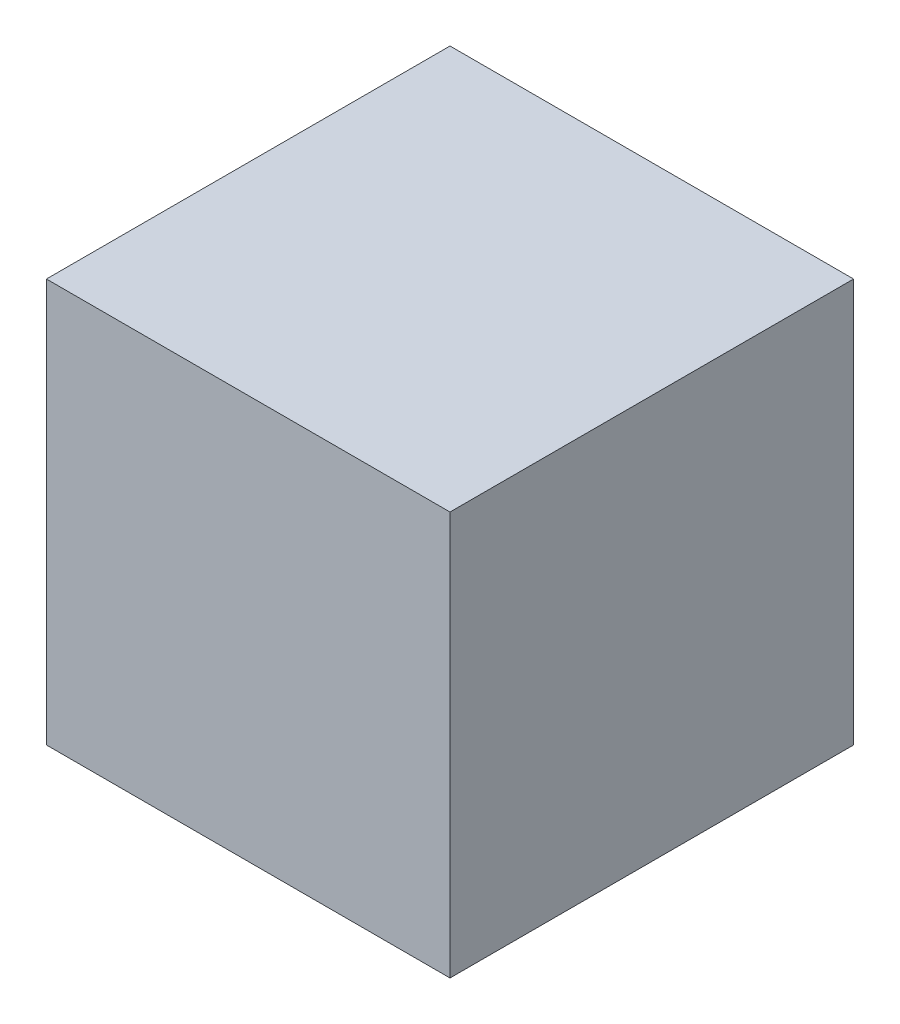
ISO-10303-21;
HEADER;
FILE_DESCRIPTION(('STEP AP214'),'2;1');
FILE_NAME('part.step','',(''),(''),'','','');
FILE_SCHEMA(('AUTOMOTIVE_DESIGN { 1 0 10303 214 1 1 1 1 }'));
ENDSEC;
DATA;
#1=APPLICATION_CONTEXT('core data for automotive mechanical design processes');
#2=APPLICATION_PROTOCOL_DEFINITION('international standard','automotive_design',2000,#1);
#3=PRODUCT_CONTEXT('',#1,'mechanical');
#4=PRODUCT('Part','Part','',(#3));
#5=PRODUCT_RELATED_PRODUCT_CATEGORY('part','',(#4));
#6=PRODUCT_DEFINITION_FORMATION('','',#4);
#7=PRODUCT_DEFINITION_CONTEXT('part definition',#1,'design');
#8=PRODUCT_DEFINITION('design','',#6,#7);
#9=PRODUCT_DEFINITION_SHAPE('','',#8);
#10=(LENGTH_UNIT() NAMED_UNIT(*) SI_UNIT(.MILLI.,.METRE.));
#11=(NAMED_UNIT(*) PLANE_ANGLE_UNIT() SI_UNIT($,.RADIAN.));
#12=(NAMED_UNIT(*) SI_UNIT($,.STERADIAN.) SOLID_ANGLE_UNIT());
#13=UNCERTAINTY_MEASURE_WITH_UNIT(LENGTH_MEASURE(1.E-05),#10,'distance_accuracy_value','');
#14=(GEOMETRIC_REPRESENTATION_CONTEXT(3) GLOBAL_UNCERTAINTY_ASSIGNED_CONTEXT((#13)) GLOBAL_UNIT_ASSIGNED_CONTEXT((#10,
#11,#12)) REPRESENTATION_CONTEXT('',''));
#15=CARTESIAN_POINT('',(0.,0.,0.));
#16=DIRECTION('',(0.,0.,1.));
#17=DIRECTION('',(1.,0.,0.));
#18=AXIS2_PLACEMENT_3D('',#15,#16,#17);
#19=CARTESIAN_POINT('',(50.,-50.,100.));
#20=DIRECTION('',(-1.,0.,0.));
#21=DIRECTION('',(0.,0.,1.));
#22=AXIS2_PLACEMENT_3D('',#19,#20,#21);
#23=PLANE('',#22);
#24=DIRECTION('',(0.,1.,0.));
#25=VECTOR('',#24,1.);
#26=CARTESIAN_POINT('',(50.,-50.,0.));
#27=LINE('',#26,#25);
#28=CARTESIAN_POINT('',(50.,-50.,0.));
#29=VERTEX_POINT('',#28);
#30=CARTESIAN_POINT('',(50.,50.,0.));
#31=VERTEX_POINT('',#30);
#32=EDGE_CURVE('E107',#29,#31,#27,.T.);
#33=ORIENTED_EDGE('',*,*,#32,.T.);
#34=DIRECTION('',(0.,0.,-1.));
#35=VECTOR('',#34,1.);
#36=CARTESIAN_POINT('',(50.,50.,100.));
#37=LINE('',#36,#35);
#38=CARTESIAN_POINT('',(50.,50.,100.));
#39=VERTEX_POINT('',#38);
#40=EDGE_CURVE('E11',#39,#31,#37,.T.);
#41=ORIENTED_EDGE('',*,*,#40,.F.);
#42=DIRECTION('',(0.,1.,0.));
#43=VECTOR('',#42,1.);
#44=CARTESIAN_POINT('',(50.,-50.,100.));
#45=LINE('',#44,#43);
#46=CARTESIAN_POINT('',(50.,-50.,100.));
#47=VERTEX_POINT('',#46);
#48=EDGE_CURVE('E91',#47,#39,#45,.T.);
#49=ORIENTED_EDGE('',*,*,#48,.F.);
#50=DIRECTION('',(0.,0.,-1.));
#51=VECTOR('',#50,1.);
#52=CARTESIAN_POINT('',(50.,-50.,100.));
#53=LINE('',#52,#51);
#54=EDGE_CURVE('E103',#47,#29,#53,.T.);
#55=ORIENTED_EDGE('',*,*,#54,.T.);
#56=EDGE_LOOP('',(#33,#41,#49,#55));
#57=FACE_BOUND('',#56,.T.);
#58=ADVANCED_FACE('F39',(#57),#23,.F.);
#59=CARTESIAN_POINT('',(-50.,50.,100.));
#60=DIRECTION('',(0.,-1.,0.));
#61=DIRECTION('',(0.,0.,-1.));
#62=AXIS2_PLACEMENT_3D('',#59,#60,#61);
#63=PLANE('',#62);
#64=DIRECTION('',(-1.,0.,0.));
#65=VECTOR('',#64,1.);
#66=CARTESIAN_POINT('',(-50.,50.,0.));
#67=LINE('',#66,#65);
#68=CARTESIAN_POINT('',(-50.,50.,0.));
#69=VERTEX_POINT('',#68);
#70=EDGE_CURVE('E96',#31,#69,#67,.T.);
#71=ORIENTED_EDGE('',*,*,#70,.T.);
#72=DIRECTION('',(0.,0.,-1.));
#73=VECTOR('',#72,1.);
#74=CARTESIAN_POINT('',(-50.,50.,100.));
#75=LINE('',#74,#73);
#76=CARTESIAN_POINT('',(-50.,50.,100.));
#77=VERTEX_POINT('',#76);
#78=EDGE_CURVE('E48',#77,#69,#75,.T.);
#79=ORIENTED_EDGE('',*,*,#78,.F.);
#80=DIRECTION('',(-1.,0.,0.));
#81=VECTOR('',#80,1.);
#82=CARTESIAN_POINT('',(-50.,50.,100.));
#83=LINE('',#82,#81);
#84=EDGE_CURVE('E86',#39,#77,#83,.T.);
#85=ORIENTED_EDGE('',*,*,#84,.F.);
#86=ORIENTED_EDGE('',*,*,#40,.T.);
#87=EDGE_LOOP('',(#71,#79,#85,#86));
#88=FACE_BOUND('',#87,.T.);
#89=ADVANCED_FACE('F95',(#88),#63,.F.);
#90=CARTESIAN_POINT('',(-50.,-50.,100.));
#91=DIRECTION('',(1.,0.,0.));
#92=DIRECTION('',(0.,0.,-1.));
#93=AXIS2_PLACEMENT_3D('',#90,#91,#92);
#94=PLANE('',#93);
#95=DIRECTION('',(0.,-1.,0.));
#96=VECTOR('',#95,1.);
#97=CARTESIAN_POINT('',(-50.,-50.,0.));
#98=LINE('',#97,#96);
#99=CARTESIAN_POINT('',(-50.,-50.,0.));
#100=VERTEX_POINT('',#99);
#101=EDGE_CURVE('E73',#69,#100,#98,.T.);
#102=ORIENTED_EDGE('',*,*,#101,.T.);
#103=DIRECTION('',(0.,0.,-1.));
#104=VECTOR('',#103,1.);
#105=CARTESIAN_POINT('',(-50.,-50.,100.));
#106=LINE('',#105,#104);
#107=CARTESIAN_POINT('',(-50.,-50.,100.));
#108=VERTEX_POINT('',#107);
#109=EDGE_CURVE('E98',#108,#100,#106,.T.);
#110=ORIENTED_EDGE('',*,*,#109,.F.);
#111=DIRECTION('',(0.,-1.,0.));
#112=VECTOR('',#111,1.);
#113=CARTESIAN_POINT('',(-50.,-50.,100.));
#114=LINE('',#113,#112);
#115=EDGE_CURVE('E89',#77,#108,#114,.T.);
#116=ORIENTED_EDGE('',*,*,#115,.F.);
#117=ORIENTED_EDGE('',*,*,#78,.T.);
#118=EDGE_LOOP('',(#102,#110,#116,#117));
#119=FACE_BOUND('',#118,.T.);
#120=ADVANCED_FACE('F99',(#119),#94,.F.);
#121=CARTESIAN_POINT('',(-50.,-50.,100.));
#122=DIRECTION('',(0.,1.,0.));
#123=DIRECTION('',(0.,0.,1.));
#124=AXIS2_PLACEMENT_3D('',#121,#122,#123);
#125=PLANE('',#124);
#126=DIRECTION('',(1.,0.,0.));
#127=VECTOR('',#126,1.);
#128=CARTESIAN_POINT('',(-50.,-50.,0.));
#129=LINE('',#128,#127);
#130=EDGE_CURVE('E79',#100,#29,#129,.T.);
#131=ORIENTED_EDGE('',*,*,#130,.T.);
#132=ORIENTED_EDGE('',*,*,#54,.F.);
#133=DIRECTION('',(1.,0.,0.));
#134=VECTOR('',#133,1.);
#135=CARTESIAN_POINT('',(-50.,-50.,100.));
#136=LINE('',#135,#134);
#137=EDGE_CURVE('E56',#108,#47,#136,.T.);
#138=ORIENTED_EDGE('',*,*,#137,.F.);
#139=ORIENTED_EDGE('',*,*,#109,.T.);
#140=EDGE_LOOP('',(#131,#132,#138,#139));
#141=FACE_BOUND('',#140,.T.);
#142=ADVANCED_FACE('F120',(#141),#125,.F.);
#143=CARTESIAN_POINT('',(0.,0.,100.));
#144=DIRECTION('',(0.,0.,-1.));
#145=DIRECTION('',(-1.,0.,0.));
#146=AXIS2_PLACEMENT_3D('',#143,#144,#145);
#147=PLANE('',#146);
#148=ORIENTED_EDGE('',*,*,#48,.T.);
#149=ORIENTED_EDGE('',*,*,#84,.T.);
#150=ORIENTED_EDGE('',*,*,#115,.T.);
#151=ORIENTED_EDGE('',*,*,#137,.T.);
#152=EDGE_LOOP('',(#148,#149,#150,#151));
#153=FACE_BOUND('',#152,.T.);
#154=ADVANCED_FACE('F87',(#153),#147,.F.);
#155=CARTESIAN_POINT('',(0.,0.,0.));
#156=DIRECTION('',(0.,0.,-1.));
#157=DIRECTION('',(-1.,0.,0.));
#158=AXIS2_PLACEMENT_3D('',#155,#156,#157);
#159=PLANE('',#158);
#160=ORIENTED_EDGE('',*,*,#32,.F.);
#161=ORIENTED_EDGE('',*,*,#130,.F.);
#162=ORIENTED_EDGE('',*,*,#101,.F.);
#163=ORIENTED_EDGE('',*,*,#70,.F.);
#164=EDGE_LOOP('',(#160,#161,#162,#163));
#165=FACE_BOUND('',#164,.T.);
#166=ADVANCED_FACE('F123',(#165),#159,.T.);
#167=CLOSED_SHELL('',(#58,#89,#120,#142,#154,#166));
#168=MANIFOLD_SOLID_BREP('B2',#167);
#169=ADVANCED_BREP_SHAPE_REPRESENTATION('',(#18,#168),#14);
#170=SHAPE_DEFINITION_REPRESENTATION(#9,#169);
ENDSEC;
END-ISO-10303-21;
